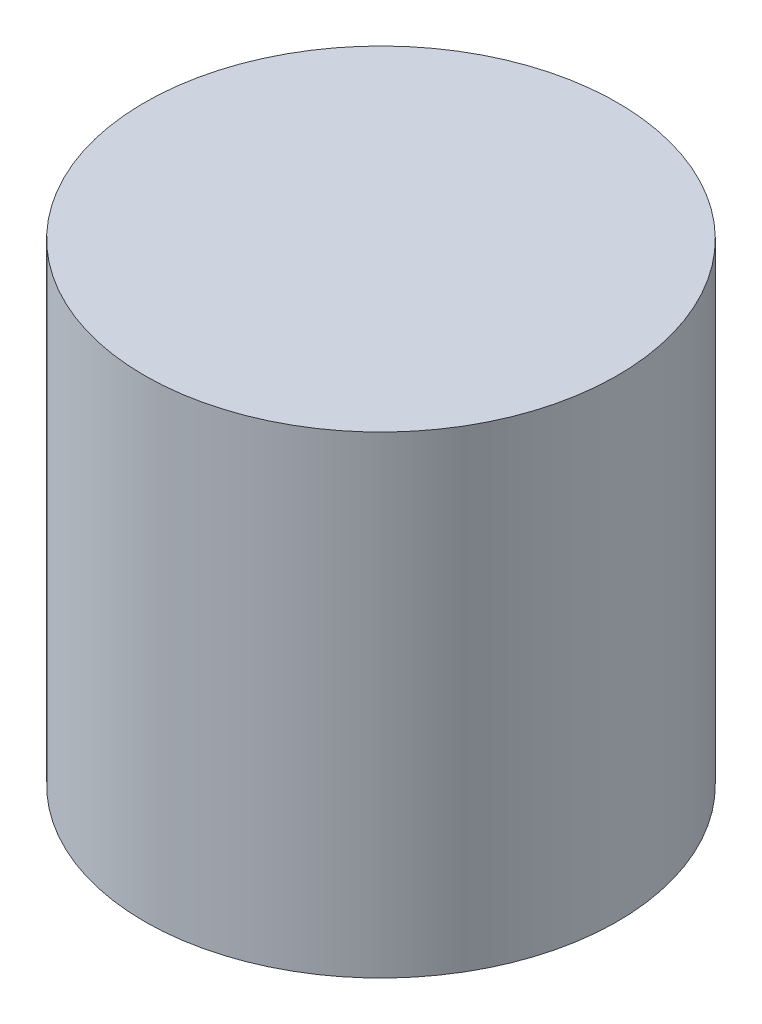
ISO-10303-21;
HEADER;
FILE_DESCRIPTION(('STEP AP214'),'2;1');
FILE_NAME('part.step','',(''),(''),'','','');
FILE_SCHEMA(('AUTOMOTIVE_DESIGN { 1 0 10303 214 1 1 1 1 }'));
ENDSEC;
DATA;
#1=APPLICATION_CONTEXT('core data for automotive mechanical design processes');
#2=APPLICATION_PROTOCOL_DEFINITION('international standard','automotive_design',2000,#1);
#3=PRODUCT_CONTEXT('',#1,'mechanical');
#4=PRODUCT('Part','Part','',(#3));
#5=PRODUCT_RELATED_PRODUCT_CATEGORY('part','',(#4));
#6=PRODUCT_DEFINITION_FORMATION('','',#4);
#7=PRODUCT_DEFINITION_CONTEXT('part definition',#1,'design');
#8=PRODUCT_DEFINITION('design','',#6,#7);
#9=PRODUCT_DEFINITION_SHAPE('','',#8);
#10=(LENGTH_UNIT() NAMED_UNIT(*) SI_UNIT(.MILLI.,.METRE.));
#11=(NAMED_UNIT(*) PLANE_ANGLE_UNIT() SI_UNIT($,.RADIAN.));
#12=(NAMED_UNIT(*) SI_UNIT($,.STERADIAN.) SOLID_ANGLE_UNIT());
#13=UNCERTAINTY_MEASURE_WITH_UNIT(LENGTH_MEASURE(1.E-05),#10,'distance_accuracy_value','');
#14=(GEOMETRIC_REPRESENTATION_CONTEXT(3) GLOBAL_UNCERTAINTY_ASSIGNED_CONTEXT((#13)) GLOBAL_UNIT_ASSIGNED_CONTEXT((#10,
#11,#12)) REPRESENTATION_CONTEXT('',''));
#15=CARTESIAN_POINT('',(0.,0.,0.));
#16=DIRECTION('',(0.,0.,1.));
#17=DIRECTION('',(1.,0.,0.));
#18=AXIS2_PLACEMENT_3D('',#15,#16,#17);
#19=CARTESIAN_POINT('',(0.,50.,0.));
#20=DIRECTION('',(0.,-1.,0.));
#21=DIRECTION('',(0.,0.,-1.));
#22=AXIS2_PLACEMENT_3D('',#19,#20,#21);
#23=CYLINDRICAL_SURFACE('',#22,25.);
#24=CARTESIAN_POINT('',(0.,50.,0.));
#25=DIRECTION('',(0.,1.,0.));
#26=DIRECTION('',(0.,0.,1.));
#27=AXIS2_PLACEMENT_3D('',#24,#25,#26);
#28=CIRCLE('',#27,25.);
#29=CARTESIAN_POINT('',(0.,50.,25.));
#30=VERTEX_POINT('',#29);
#31=EDGE_CURVE('E10',#30,#30,#28,.T.);
#32=ORIENTED_EDGE('',*,*,#31,.F.);
#33=EDGE_LOOP('',(#32));
#34=FACE_BOUND('',#33,.T.);
#35=CARTESIAN_POINT('',(0.,0.,0.));
#36=DIRECTION('',(0.,1.,0.));
#37=DIRECTION('',(0.,0.,1.));
#38=AXIS2_PLACEMENT_3D('',#35,#36,#37);
#39=CIRCLE('',#38,25.);
#40=CARTESIAN_POINT('',(0.,0.,25.));
#41=VERTEX_POINT('',#40);
#42=EDGE_CURVE('E40',#41,#41,#39,.T.);
#43=ORIENTED_EDGE('',*,*,#42,.T.);
#44=EDGE_LOOP('',(#43));
#45=FACE_BOUND('',#44,.T.);
#46=ADVANCED_FACE('F37',(#34,#45),#23,.T.);
#47=CARTESIAN_POINT('',(0.,50.,0.));
#48=DIRECTION('',(0.,1.,0.));
#49=DIRECTION('',(0.,0.,1.));
#50=AXIS2_PLACEMENT_3D('',#47,#48,#49);
#51=PLANE('',#50);
#52=ORIENTED_EDGE('',*,*,#31,.T.);
#53=EDGE_LOOP('',(#52));
#54=FACE_BOUND('',#53,.T.);
#55=ADVANCED_FACE('F52',(#54),#51,.T.);
#56=CARTESIAN_POINT('',(0.,0.,0.));
#57=DIRECTION('',(0.,1.,0.));
#58=DIRECTION('',(0.,0.,1.));
#59=AXIS2_PLACEMENT_3D('',#56,#57,#58);
#60=PLANE('',#59);
#61=ORIENTED_EDGE('',*,*,#42,.F.);
#62=EDGE_LOOP('',(#61));
#63=FACE_BOUND('',#62,.T.);
#64=ADVANCED_FACE('F50',(#63),#60,.F.);
#65=CLOSED_SHELL('',(#46,#55,#64));
#66=MANIFOLD_SOLID_BREP('B2',#65);
#67=ADVANCED_BREP_SHAPE_REPRESENTATION('',(#18,#66),#14);
#68=SHAPE_DEFINITION_REPRESENTATION(#9,#67);
ENDSEC;
END-ISO-10303-21;
